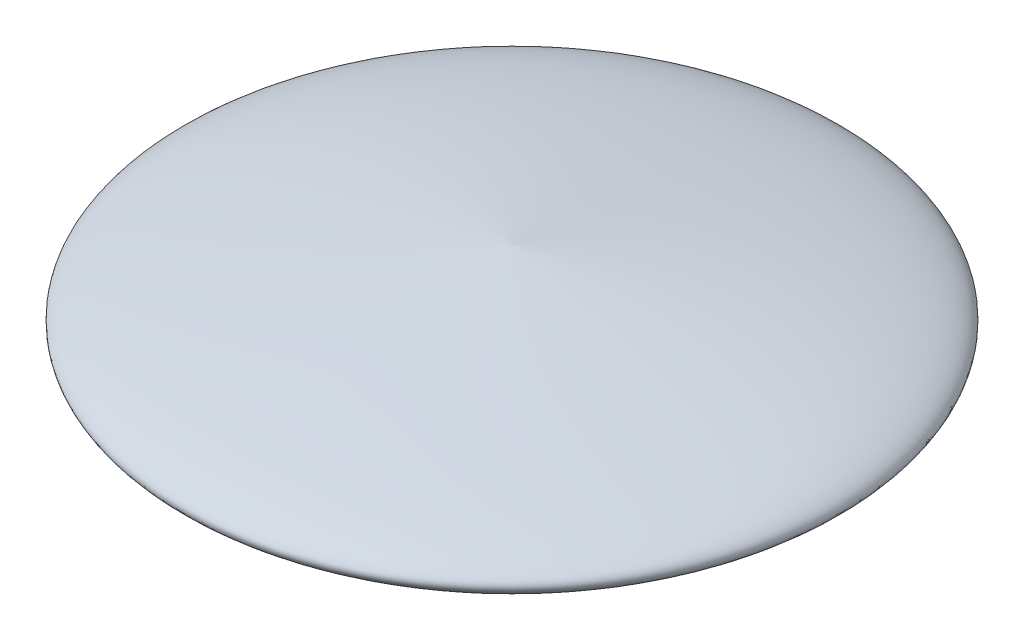
ISO-10303-21;
HEADER;
FILE_DESCRIPTION(('STEP AP214'),'2;1');
FILE_NAME('part.step','',(''),(''),'','','');
FILE_SCHEMA(('AUTOMOTIVE_DESIGN { 1 0 10303 214 1 1 1 1 }'));
ENDSEC;
DATA;
#1=APPLICATION_CONTEXT('core data for automotive mechanical design processes');
#2=APPLICATION_PROTOCOL_DEFINITION('international standard','automotive_design',2000,#1);
#3=PRODUCT_CONTEXT('',#1,'mechanical');
#4=PRODUCT('Part','Part','',(#3));
#5=PRODUCT_RELATED_PRODUCT_CATEGORY('part','',(#4));
#6=PRODUCT_DEFINITION_FORMATION('','',#4);
#7=PRODUCT_DEFINITION_CONTEXT('part definition',#1,'design');
#8=PRODUCT_DEFINITION('design','',#6,#7);
#9=PRODUCT_DEFINITION_SHAPE('','',#8);
#10=(LENGTH_UNIT() NAMED_UNIT(*) SI_UNIT(.MILLI.,.METRE.));
#11=(NAMED_UNIT(*) PLANE_ANGLE_UNIT() SI_UNIT($,.RADIAN.));
#12=(NAMED_UNIT(*) SI_UNIT($,.STERADIAN.) SOLID_ANGLE_UNIT());
#13=UNCERTAINTY_MEASURE_WITH_UNIT(LENGTH_MEASURE(1.E-05),#10,'distance_accuracy_value','');
#14=(GEOMETRIC_REPRESENTATION_CONTEXT(3) GLOBAL_UNCERTAINTY_ASSIGNED_CONTEXT((#13)) GLOBAL_UNIT_ASSIGNED_CONTEXT((#10,
#11,#12)) REPRESENTATION_CONTEXT('',''));
#15=CARTESIAN_POINT('',(0.,0.,0.));
#16=DIRECTION('',(0.,0.,1.));
#17=DIRECTION('',(1.,0.,0.));
#18=AXIS2_PLACEMENT_3D('',#15,#16,#17);
#19=CARTESIAN_POINT('',(20.,7.02066713754342,15.4793328624566));
#20=CARTESIAN_POINT('',(20.,7.02066713754342,15.4793328624566));
#21=CARTESIAN_POINT('',(20.,7.02066713754342,15.4793328624566));
#22=CARTESIAN_POINT('',(20.,7.02066713754342,15.4793328624566));
#23=CARTESIAN_POINT('',(20.,7.02066713754342,15.4793328624566));
#24=CARTESIAN_POINT('',(20.,7.02066713754342,15.4793328624566));
#25=CARTESIAN_POINT('',(20.,7.02066713754342,15.4793328624566));
#26=CARTESIAN_POINT('',(20.,7.02066713754342,15.4793328624566));
#27=CARTESIAN_POINT('',(20.,7.02066713754342,15.4793328624566));
#28=CARTESIAN_POINT('',(19.0367353632279,6.92066713754354,15.4793328624566));
#29=CARTESIAN_POINT('',(19.0367353632279,6.92066713754354,16.4425974992287));
#30=CARTESIAN_POINT('',(20.,6.92066713754354,16.4425974992287));
#31=CARTESIAN_POINT('',(20.9632646367721,6.92066713754354,16.4425974992287));
#32=CARTESIAN_POINT('',(20.9632646367721,6.92066713754354,15.4793328624566));
#33=CARTESIAN_POINT('',(20.9632646367721,6.92066713754354,14.5160682256845));
#34=CARTESIAN_POINT('',(20.,6.92066713754354,14.5160682256845));
#35=CARTESIAN_POINT('',(19.0367353632279,6.92066713754354,14.5160682256845));
#36=CARTESIAN_POINT('',(19.0367353632279,6.92066713754354,15.4793328624566));
#37=CARTESIAN_POINT('',(17.1943275313863,6.72066713754375,15.4793328624566));
#38=CARTESIAN_POINT('',(17.1943275313863,6.72066713754375,18.2850053310703));
#39=CARTESIAN_POINT('',(20.,6.72066713754375,18.2850053310703));
#40=CARTESIAN_POINT('',(22.8056724686137,6.72066713754375,18.2850053310703));
#41=CARTESIAN_POINT('',(22.8056724686137,6.72066713754375,15.4793328624566));
#42=CARTESIAN_POINT('',(22.8056724686137,6.72066713754375,12.6736603938428));
#43=CARTESIAN_POINT('',(20.,6.72066713754375,12.6736603938428));
#44=CARTESIAN_POINT('',(17.1943275313863,6.72066713754375,12.6736603938428));
#45=CARTESIAN_POINT('',(17.1943275313863,6.72066713754375,15.4793328624566));
#46=CARTESIAN_POINT('',(14.6830723747566,6.42066713754398,15.4793328624566));
#47=CARTESIAN_POINT('',(14.6830723747566,6.42066713754398,20.7962604877));
#48=CARTESIAN_POINT('',(20.,6.42066713754398,20.7962604877));
#49=CARTESIAN_POINT('',(25.3169276252434,6.42066713754398,20.7962604877));
#50=CARTESIAN_POINT('',(25.3169276252434,6.42066713754398,15.4793328624566));
#51=CARTESIAN_POINT('',(25.3169276252434,6.42066713754398,10.1624052372131));
#52=CARTESIAN_POINT('',(20.,6.42066713754398,10.1624052372131));
#53=CARTESIAN_POINT('',(14.6830723747566,6.42066713754398,10.1624052372131));
#54=CARTESIAN_POINT('',(14.6830723747566,6.42066713754398,15.4793328624566));
#55=CARTESIAN_POINT('',(11.8478156919877,6.02066713754411,15.4793328624566));
#56=CARTESIAN_POINT('',(11.8478156919877,6.02066713754411,23.6315171704688));
#57=CARTESIAN_POINT('',(20.,6.02066713754411,23.6315171704688));
#58=CARTESIAN_POINT('',(28.1521843080123,6.02066713754411,23.6315171704688));
#59=CARTESIAN_POINT('',(28.1521843080123,6.02066713754411,15.4793328624566));
#60=CARTESIAN_POINT('',(28.1521843080123,6.02066713754411,7.32714855444432));
#61=CARTESIAN_POINT('',(20.,6.02066713754411,7.32714855444432));
#62=CARTESIAN_POINT('',(11.8478156919877,6.02066713754411,7.32714855444432));
#63=CARTESIAN_POINT('',(11.8478156919877,6.02066713754411,15.4793328624566));
#64=CARTESIAN_POINT('',(9.21692035399318,5.52066713754404,15.4793328624566));
#65=CARTESIAN_POINT('',(9.21692035399318,5.52066713754404,26.2624125084634));
#66=CARTESIAN_POINT('',(20.,5.52066713754404,26.2624125084634));
#67=CARTESIAN_POINT('',(30.7830796460068,5.52066713754404,26.2624125084634));
#68=CARTESIAN_POINT('',(30.7830796460068,5.52066713754404,15.4793328624566));
#69=CARTESIAN_POINT('',(30.7830796460068,5.52066713754405,4.69625321644976));
#70=CARTESIAN_POINT('',(20.,5.52066713754405,4.69625321644976));
#71=CARTESIAN_POINT('',(9.21692035399318,5.52066713754405,4.69625321644976));
#72=CARTESIAN_POINT('',(9.21692035399318,5.52066713754404,15.4793328624566));
#73=CARTESIAN_POINT('',(7.58081015796529,5.02066713754379,15.4793328624566));
#74=CARTESIAN_POINT('',(7.5808101579653,5.02066713754379,27.8985227044913));
#75=CARTESIAN_POINT('',(20.,5.02066713754379,27.8985227044913));
#76=CARTESIAN_POINT('',(32.4191898420347,5.02066713754379,27.8985227044913));
#77=CARTESIAN_POINT('',(32.4191898420347,5.02066713754379,15.4793328624566));
#78=CARTESIAN_POINT('',(32.4191898420347,5.02066713754379,3.06014302042188));
#79=CARTESIAN_POINT('',(20.,5.02066713754379,3.06014302042188));
#80=CARTESIAN_POINT('',(7.5808101579653,5.02066713754379,3.06014302042188));
#81=CARTESIAN_POINT('',(7.58081015796529,5.02066713754379,15.4793328624566));
#82=CARTESIAN_POINT('',(7.02066713754343,4.52066713754343,15.4793328624566));
#83=CARTESIAN_POINT('',(7.02066713754343,4.52066713754343,28.4586657249132));
#84=CARTESIAN_POINT('',(20.,4.52066713754343,28.4586657249132));
#85=CARTESIAN_POINT('',(32.9793328624566,4.52066713754343,28.4586657249132));
#86=CARTESIAN_POINT('',(32.9793328624566,4.52066713754343,15.4793328624566));
#87=CARTESIAN_POINT('',(32.9793328624566,4.52066713754343,2.50000000000001));
#88=CARTESIAN_POINT('',(20.,4.52066713754343,2.5));
#89=CARTESIAN_POINT('',(7.02066713754343,4.52066713754343,2.50000000000001));
#90=CARTESIAN_POINT('',(7.02066713754343,4.52066713754343,15.4793328624566));
#91=CARTESIAN_POINT('',(7.58081015796356,4.02066713754304,15.4793328624566));
#92=CARTESIAN_POINT('',(7.58081015796358,4.02066713754304,27.898522704493));
#93=CARTESIAN_POINT('',(20.,4.02066713754304,27.898522704493));
#94=CARTESIAN_POINT('',(32.4191898420364,4.02066713754304,27.898522704493));
#95=CARTESIAN_POINT('',(32.4191898420364,4.02066713754304,15.4793328624566));
#96=CARTESIAN_POINT('',(32.4191898420364,4.02066713754304,3.06014302042015));
#97=CARTESIAN_POINT('',(20.,4.02066713754304,3.06014302042015));
#98=CARTESIAN_POINT('',(7.58081015796358,4.02066713754304,3.06014302042015));
#99=CARTESIAN_POINT('',(7.58081015796356,4.02066713754304,15.4793328624566));
#100=CARTESIAN_POINT('',(9.21692035399014,3.52066713754273,15.4793328624566));
#101=CARTESIAN_POINT('',(9.21692035399015,3.52066713754272,26.2624125084664));
#102=CARTESIAN_POINT('',(20.,3.52066713754272,26.2624125084664));
#103=CARTESIAN_POINT('',(30.7830796460099,3.52066713754272,26.2624125084664));
#104=CARTESIAN_POINT('',(30.7830796460099,3.52066713754273,15.4793328624566));
#105=CARTESIAN_POINT('',(30.7830796460099,3.52066713754273,4.69625321644673));
#106=CARTESIAN_POINT('',(20.,3.52066713754273,4.69625321644672));
#107=CARTESIAN_POINT('',(9.21692035399015,3.52066713754273,4.69625321644673));
#108=CARTESIAN_POINT('',(9.21692035399014,3.52066713754273,15.4793328624566));
#109=CARTESIAN_POINT('',(11.8478156919842,3.0206671375426,15.4793328624566));
#110=CARTESIAN_POINT('',(11.8478156919842,3.0206671375426,23.6315171704723));
#111=CARTESIAN_POINT('',(20.,3.0206671375426,23.6315171704723));
#112=CARTESIAN_POINT('',(28.1521843080158,3.0206671375426,23.6315171704723));
#113=CARTESIAN_POINT('',(28.1521843080158,3.0206671375426,15.4793328624566));
#114=CARTESIAN_POINT('',(28.1521843080158,3.0206671375426,7.32714855444082));
#115=CARTESIAN_POINT('',(20.,3.0206671375426,7.32714855444083));
#116=CARTESIAN_POINT('',(11.8478156919842,3.0206671375426,7.32714855444082));
#117=CARTESIAN_POINT('',(11.8478156919842,3.0206671375426,15.4793328624566));
#118=CARTESIAN_POINT('',(14.6830723747537,2.62066713754274,15.4793328624566));
#119=CARTESIAN_POINT('',(14.6830723747537,2.62066713754274,20.7962604877029));
#120=CARTESIAN_POINT('',(20.,2.62066713754274,20.7962604877029));
#121=CARTESIAN_POINT('',(25.3169276252463,2.62066713754274,20.7962604877029));
#122=CARTESIAN_POINT('',(25.3169276252463,2.62066713754274,15.4793328624566));
#123=CARTESIAN_POINT('',(25.3169276252463,2.62066713754274,10.1624052372103));
#124=CARTESIAN_POINT('',(20.,2.62066713754274,10.1624052372103));
#125=CARTESIAN_POINT('',(14.6830723747537,2.62066713754274,10.1624052372103));
#126=CARTESIAN_POINT('',(14.6830723747537,2.62066713754274,15.4793328624566));
#127=CARTESIAN_POINT('',(17.1943275313846,2.32066713754301,15.4793328624566));
#128=CARTESIAN_POINT('',(17.1943275313846,2.32066713754301,18.285005331072));
#129=CARTESIAN_POINT('',(20.,2.32066713754301,18.285005331072));
#130=CARTESIAN_POINT('',(22.8056724686154,2.32066713754301,18.285005331072));
#131=CARTESIAN_POINT('',(22.8056724686154,2.32066713754301,15.4793328624566));
#132=CARTESIAN_POINT('',(22.8056724686154,2.32066713754301,12.6736603938411));
#133=CARTESIAN_POINT('',(20.,2.32066713754301,12.6736603938411));
#134=CARTESIAN_POINT('',(17.1943275313846,2.32066713754301,12.6736603938411));
#135=CARTESIAN_POINT('',(17.1943275313846,2.32066713754301,15.4793328624566));
#136=CARTESIAN_POINT('',(19.0367353632273,2.12066713754327,15.4793328624566));
#137=CARTESIAN_POINT('',(19.0367353632273,2.12066713754327,16.4425974992293));
#138=CARTESIAN_POINT('',(20.,2.12066713754327,16.4425974992293));
#139=CARTESIAN_POINT('',(20.9632646367727,2.12066713754327,16.4425974992293));
#140=CARTESIAN_POINT('',(20.9632646367727,2.12066713754327,15.4793328624566));
#141=CARTESIAN_POINT('',(20.9632646367727,2.12066713754327,14.5160682256839));
#142=CARTESIAN_POINT('',(20.,2.12066713754327,14.5160682256839));
#143=CARTESIAN_POINT('',(19.0367353632273,2.12066713754327,14.5160682256839));
#144=CARTESIAN_POINT('',(19.0367353632273,2.12066713754327,15.4793328624566));
#145=CARTESIAN_POINT('',(20.,2.02066713754342,15.4793328624566));
#146=CARTESIAN_POINT('',(20.,2.02066713754342,15.4793328624566));
#147=CARTESIAN_POINT('',(20.,2.02066713754342,15.4793328624566));
#148=CARTESIAN_POINT('',(20.,2.02066713754342,15.4793328624566));
#149=CARTESIAN_POINT('',(20.,2.02066713754342,15.4793328624566));
#150=CARTESIAN_POINT('',(20.,2.02066713754342,15.4793328624566));
#151=CARTESIAN_POINT('',(20.,2.02066713754342,15.4793328624566));
#152=CARTESIAN_POINT('',(20.,2.02066713754342,15.4793328624566));
#153=CARTESIAN_POINT('',(20.,2.02066713754342,15.4793328624566));
#154=(BOUNDED_SURFACE() B_SPLINE_SURFACE(5,2,((#19,#20,#21,#22,#23,#24,#25,#26,#27),(#28,#29,
#30,#31,#32,#33,#34,#35,#36),(#37,#38,#39,#40,#41,#42,#43,#44,#45),(#46,#47,#48,#49,#50,#51,#52,
#53,#54),(#55,#56,#57,#58,#59,#60,#61,#62,#63),(#64,#65,#66,#67,#68,#69,#70,#71,#72),(#73,#74,
#75,#76,#77,#78,#79,#80,#81),(#82,#83,#84,#85,#86,#87,#88,#89,#90),(#91,#92,#93,#94,#95,#96,#97,
#98,#99),(#100,#101,#102,#103,#104,#105,#106,#107,#108),(#109,#110,#111,#112,#113,#114,#115,
#116,#117),(#118,#119,#120,#121,#122,#123,#124,#125,#126),(#127,#128,#129,#130,#131,#132,#133,
#134,#135),(#136,#137,#138,#139,#140,#141,#142,#143,#144),(#145,#146,#147,#148,#149,#150,#151,
#152,#153)),.UNSPECIFIED.,.F.,.T.,.F.) B_SPLINE_SURFACE_WITH_KNOTS((6,1,1,1,1,1,1,1,1,1,6),(3,2,
2,2,3),(0.,0.1,0.2,0.3,0.4,0.5,0.6,0.7,0.8,0.9,1.),(0.,1.5707963267949,3.14159265358979,
4.71238898038469,6.28318530717959),
.UNSPECIFIED.) GEOMETRIC_REPRESENTATION_ITEM() RATIONAL_B_SPLINE_SURFACE(((1.,0.707106781186548,
1.,0.707106781186548,1.,0.707106781186548,1.,0.707106781186548,1.),(1.,0.707106781186548,1.,
0.707106781186548,1.,0.707106781186548,1.,0.707106781186548,1.),(1.,0.707106781186548,1.,
0.707106781186548,1.,0.707106781186548,1.,0.707106781186548,1.),(1.,0.707106781186548,1.,
0.707106781186548,1.,0.707106781186548,1.,0.707106781186548,1.),(1.,0.707106781186548,1.,
0.707106781186548,1.,0.707106781186548,1.,0.707106781186548,1.),(1.,0.707106781186548,1.,
0.707106781186548,1.,0.707106781186548,1.,0.707106781186548,1.),(1.,0.707106781186548,1.,
0.707106781186548,1.,0.707106781186548,1.,0.707106781186548,1.),(1.,0.707106781186548,1.,
0.707106781186548,1.,0.707106781186548,1.,0.707106781186548,1.),(1.,0.707106781186548,1.,
0.707106781186548,1.,0.707106781186548,1.,0.707106781186548,1.),(1.,0.707106781186548,1.,
0.707106781186548,1.,0.707106781186548,1.,0.707106781186548,1.),(1.,0.707106781186548,1.,
0.707106781186548,1.,0.707106781186548,1.,0.707106781186548,1.),(1.,0.707106781186548,1.,
0.707106781186548,1.,0.707106781186548,1.,0.707106781186548,1.),(1.,0.707106781186548,1.,
0.707106781186548,1.,0.707106781186548,1.,0.707106781186548,1.),(1.,0.707106781186548,1.,
0.707106781186548,1.,0.707106781186548,1.,0.707106781186548,1.),(1.,0.707106781186548,1.,
0.707106781186548,1.,0.707106781186548,1.,0.707106781186548,1.))) REPRESENTATION_ITEM('') SURFACE());
#155=CARTESIAN_POINT('',(20.,7.02066713754342,15.4793328624566));
#156=CARTESIAN_POINT('',(19.0367353632279,6.92066713754354,15.4793328624566));
#157=CARTESIAN_POINT('',(17.1943275313863,6.72066713754375,15.4793328624566));
#158=CARTESIAN_POINT('',(14.6830723747566,6.42066713754398,15.4793328624566));
#159=CARTESIAN_POINT('',(11.8478156919877,6.02066713754411,15.4793328624566));
#160=CARTESIAN_POINT('',(9.21692035399318,5.52066713754404,15.4793328624566));
#161=CARTESIAN_POINT('',(7.58081015796529,5.02066713754379,15.4793328624566));
#162=CARTESIAN_POINT('',(7.02066713754343,4.52066713754343,15.4793328624566));
#163=CARTESIAN_POINT('',(7.58081015796356,4.02066713754304,15.4793328624566));
#164=CARTESIAN_POINT('',(9.21692035399014,3.52066713754273,15.4793328624566));
#165=CARTESIAN_POINT('',(11.8478156919842,3.0206671375426,15.4793328624566));
#166=CARTESIAN_POINT('',(14.6830723747537,2.62066713754274,15.4793328624566));
#167=CARTESIAN_POINT('',(17.1943275313846,2.32066713754301,15.4793328624566));
#168=CARTESIAN_POINT('',(19.0367353632273,2.12066713754327,15.4793328624566));
#169=CARTESIAN_POINT('',(20.,2.02066713754342,15.4793328624566));
#170=(BOUNDED_CURVE() B_SPLINE_CURVE(5,(#155,#156,#157,#158,#159,#160,#161,#162,#163,#164,#165,
#166,#167,#168,#169),.UNSPECIFIED.,.F.,.F.) B_SPLINE_CURVE_WITH_KNOTS((6,1,1,1,1,1,1,1,1,1,6),
(0.,0.1,0.2,0.3,0.4,0.5,0.6,0.7,0.8,0.9,1.),
.UNSPECIFIED.) CURVE() GEOMETRIC_REPRESENTATION_ITEM() RATIONAL_B_SPLINE_CURVE((1.,1.,1.,1.,1.,
1.,1.,1.,1.,1.,1.,1.,1.,1.,1.)) REPRESENTATION_ITEM(''));
#171=CARTESIAN_POINT('',(20.,7.02066713754342,15.4793328624566));
#172=VERTEX_POINT('',#171);
#173=CARTESIAN_POINT('',(20.,2.02066713754342,15.4793328624566));
#174=VERTEX_POINT('',#173);
#175=EDGE_CURVE('E11',#172,#174,#170,.T.);
#176=ORIENTED_EDGE('',*,*,#175,.T.);
#177=ORIENTED_EDGE('',*,*,#175,.F.);
#178=EDGE_LOOP('',(#176,#177));
#179=FACE_BOUND('',#178,.T.);
#180=ADVANCED_FACE('F17',(#179),#154,.T.);
#181=CLOSED_SHELL('',(#180));
#182=MANIFOLD_SOLID_BREP('B1',#181);
#183=ADVANCED_BREP_SHAPE_REPRESENTATION('',(#18,#182),#14);
#184=SHAPE_DEFINITION_REPRESENTATION(#9,#183);
ENDSEC;
END-ISO-10303-21;
